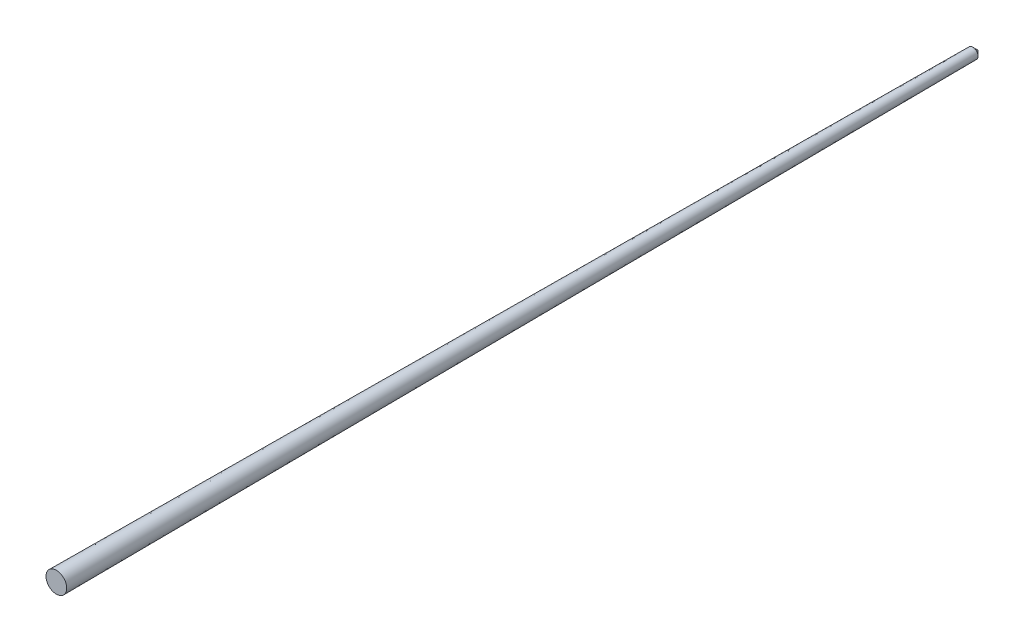
ISO-10303-21;
HEADER;
FILE_DESCRIPTION(('STEP AP214'),'2;1');
FILE_NAME('part.step','',(''),(''),'','','');
FILE_SCHEMA(('AUTOMOTIVE_DESIGN { 1 0 10303 214 1 1 1 1 }'));
ENDSEC;
DATA;
#1=APPLICATION_CONTEXT('core data for automotive mechanical design processes');
#2=APPLICATION_PROTOCOL_DEFINITION('international standard','automotive_design',2000,#1);
#3=PRODUCT_CONTEXT('',#1,'mechanical');
#4=PRODUCT('Part','Part','',(#3));
#5=PRODUCT_RELATED_PRODUCT_CATEGORY('part','',(#4));
#6=PRODUCT_DEFINITION_FORMATION('','',#4);
#7=PRODUCT_DEFINITION_CONTEXT('part definition',#1,'design');
#8=PRODUCT_DEFINITION('design','',#6,#7);
#9=PRODUCT_DEFINITION_SHAPE('','',#8);
#10=(LENGTH_UNIT() NAMED_UNIT(*) SI_UNIT(.MILLI.,.METRE.));
#11=(NAMED_UNIT(*) PLANE_ANGLE_UNIT() SI_UNIT($,.RADIAN.));
#12=(NAMED_UNIT(*) SI_UNIT($,.STERADIAN.) SOLID_ANGLE_UNIT());
#13=UNCERTAINTY_MEASURE_WITH_UNIT(LENGTH_MEASURE(1.E-05),#10,'distance_accuracy_value','');
#14=(GEOMETRIC_REPRESENTATION_CONTEXT(3) GLOBAL_UNCERTAINTY_ASSIGNED_CONTEXT((#13)) GLOBAL_UNIT_ASSIGNED_CONTEXT((#10,
#11,#12)) REPRESENTATION_CONTEXT('',''));
#15=CARTESIAN_POINT('',(0.,0.,0.));
#16=DIRECTION('',(0.,0.,1.));
#17=DIRECTION('',(1.,0.,0.));
#18=AXIS2_PLACEMENT_3D('',#15,#16,#17);
#19=CARTESIAN_POINT('',(0.,0.,-355.6));
#20=DIRECTION('',(0.,0.,1.));
#21=DIRECTION('',(1.,0.,0.));
#22=AXIS2_PLACEMENT_3D('',#19,#20,#21);
#23=CONICAL_SURFACE('',#22,2.02,0.785398163397429);
#24=CARTESIAN_POINT('',(0.,0.,-357.62));
#25=VERTEX_POINT('',#24);
#26=VERTEX_LOOP('',#25);
#27=FACE_BOUND('',#26,.T.);
#28=CARTESIAN_POINT('',(0.,0.,-355.6));
#29=DIRECTION('',(0.,0.,-1.));
#30=DIRECTION('',(-1.,0.,0.));
#31=AXIS2_PLACEMENT_3D('',#28,#29,#30);
#32=CIRCLE('',#31,2.02);
#33=CARTESIAN_POINT('',(-2.02,0.,-355.6));
#34=VERTEX_POINT('',#33);
#35=EDGE_CURVE('E41',#34,#34,#32,.T.);
#36=ORIENTED_EDGE('',*,*,#35,.T.);
#37=EDGE_LOOP('',(#36));
#38=FACE_BOUND('',#37,.T.);
#39=ADVANCED_FACE('F35',(#27,#38),#23,.T.);
#40=CARTESIAN_POINT('',(0.,0.,0.));
#41=DIRECTION('',(0.,0.,-1.));
#42=DIRECTION('',(-1.,0.,0.));
#43=AXIS2_PLACEMENT_3D('',#40,#41,#42);
#44=PLANE('',#43);
#45=CARTESIAN_POINT('',(0.,0.,0.));
#46=DIRECTION('',(0.,0.,-1.));
#47=DIRECTION('',(-1.,0.,0.));
#48=AXIS2_PLACEMENT_3D('',#45,#46,#47);
#49=CIRCLE('',#48,4.02);
#50=CARTESIAN_POINT('',(-4.02,0.,0.));
#51=VERTEX_POINT('',#50);
#52=EDGE_CURVE('E11',#51,#51,#49,.T.);
#53=ORIENTED_EDGE('',*,*,#52,.F.);
#54=EDGE_LOOP('',(#53));
#55=FACE_BOUND('',#54,.T.);
#56=ADVANCED_FACE('F46',(#55),#44,.F.);
#57=CARTESIAN_POINT('',(0.,0.,0.));
#58=DIRECTION('',(0.,0.,1.));
#59=DIRECTION('',(1.,0.,0.));
#60=AXIS2_PLACEMENT_3D('',#57,#58,#59);
#61=CONICAL_SURFACE('',#60,4.02,0.00562423766007506);
#62=ORIENTED_EDGE('',*,*,#35,.F.);
#63=EDGE_LOOP('',(#62));
#64=FACE_BOUND('',#63,.T.);
#65=ORIENTED_EDGE('',*,*,#52,.T.);
#66=EDGE_LOOP('',(#65));
#67=FACE_BOUND('',#66,.T.);
#68=ADVANCED_FACE('F50',(#64,#67),#61,.T.);
#69=CLOSED_SHELL('',(#39,#56,#68));
#70=MANIFOLD_SOLID_BREP('B2',#69);
#71=ADVANCED_BREP_SHAPE_REPRESENTATION('',(#18,#70),#14);
#72=SHAPE_DEFINITION_REPRESENTATION(#9,#71);
ENDSEC;
END-ISO-10303-21;
